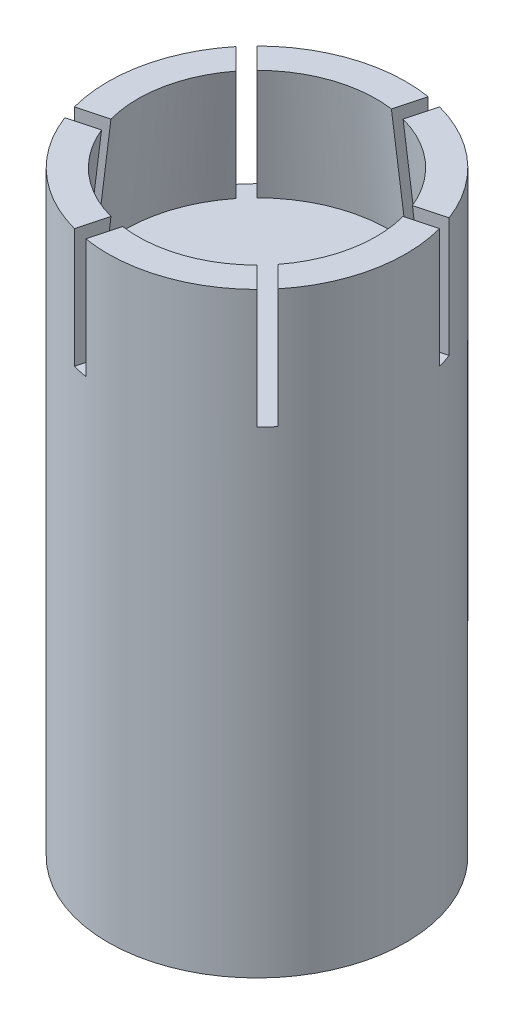
ISO-10303-21;
HEADER;
FILE_DESCRIPTION(('STEP AP214'),'2;1');
FILE_NAME('part.step','',(''),(''),'','','');
FILE_SCHEMA(('AUTOMOTIVE_DESIGN { 1 0 10303 214 1 1 1 1 }'));
ENDSEC;
DATA;
#1=APPLICATION_CONTEXT('core data for automotive mechanical design processes');
#2=APPLICATION_PROTOCOL_DEFINITION('international standard','automotive_design',2000,#1);
#3=PRODUCT_CONTEXT('',#1,'mechanical');
#4=PRODUCT('Part','Part','',(#3));
#5=PRODUCT_RELATED_PRODUCT_CATEGORY('part','',(#4));
#6=PRODUCT_DEFINITION_FORMATION('','',#4);
#7=PRODUCT_DEFINITION_CONTEXT('part definition',#1,'design');
#8=PRODUCT_DEFINITION('design','',#6,#7);
#9=PRODUCT_DEFINITION_SHAPE('','',#8);
#10=(LENGTH_UNIT() NAMED_UNIT(*) SI_UNIT(.MILLI.,.METRE.));
#11=(NAMED_UNIT(*) PLANE_ANGLE_UNIT() SI_UNIT($,.RADIAN.));
#12=(NAMED_UNIT(*) SI_UNIT($,.STERADIAN.) SOLID_ANGLE_UNIT());
#13=UNCERTAINTY_MEASURE_WITH_UNIT(LENGTH_MEASURE(1.E-05),#10,'distance_accuracy_value','');
#14=(GEOMETRIC_REPRESENTATION_CONTEXT(3) GLOBAL_UNCERTAINTY_ASSIGNED_CONTEXT((#13)) GLOBAL_UNIT_ASSIGNED_CONTEXT((#10,
#11,#12)) REPRESENTATION_CONTEXT('',''));
#15=CARTESIAN_POINT('',(0.,0.,0.));
#16=DIRECTION('',(0.,0.,1.));
#17=DIRECTION('',(1.,0.,0.));
#18=AXIS2_PLACEMENT_3D('',#15,#16,#17);
#19=CARTESIAN_POINT('',(0.,5.53381234632872,0.));
#20=DIRECTION('',(0.,1.,0.));
#21=DIRECTION('',(0.,0.,1.));
#22=AXIS2_PLACEMENT_3D('',#19,#20,#21);
#23=CYLINDRICAL_SURFACE('',#22,5.00000000000001);
#24=CARTESIAN_POINT('',(0.,-20.,0.));
#25=DIRECTION('',(0.,1.,0.));
#26=DIRECTION('',(0.,0.,1.));
#27=AXIS2_PLACEMENT_3D('',#24,#25,#26);
#28=CIRCLE('',#27,5.00000000000001);
#29=CARTESIAN_POINT('',(0.,-20.,5.00000000000001));
#30=VERTEX_POINT('',#29);
#31=EDGE_CURVE('E294',#30,#30,#28,.T.);
#32=ORIENTED_EDGE('',*,*,#31,.T.);
#33=EDGE_LOOP('',(#32));
#34=FACE_BOUND('',#33,.T.);
#35=DIRECTION('',(0.,1.,0.));
#36=VECTOR('',#35,1.);
#37=CARTESIAN_POINT('',(-4.67601078912102,5.53381234632872,1.77057140494924));
#38=LINE('',#37,#36);
#39=CARTESIAN_POINT('',(-4.67601078912102,-4.,1.77057140494924));
#40=VERTEX_POINT('',#39);
#41=CARTESIAN_POINT('',(-4.67601078912102,0.,1.77057140494924));
#42=VERTEX_POINT('',#41);
#43=EDGE_CURVE('E270',#40,#42,#38,.T.);
#44=ORIENTED_EDGE('',*,*,#43,.F.);
#45=CARTESIAN_POINT('',(0.,-4.,0.));
#46=DIRECTION('',(0.,-1.,0.));
#47=DIRECTION('',(-0.86602540378444,0.,-0.499999999999998));
#48=AXIS2_PLACEMENT_3D('',#45,#46,#47);
#49=CIRCLE('',#48,5.00000000000001);
#50=CARTESIAN_POINT('',(-4.82962913144535,-4.,1.29409522551261));
#51=VERTEX_POINT('',#50);
#52=EDGE_CURVE('E277',#40,#51,#49,.T.);
#53=ORIENTED_EDGE('',*,*,#52,.T.);
#54=DIRECTION('',(0.,1.,0.));
#55=VECTOR('',#54,1.);
#56=CARTESIAN_POINT('',(-4.82962913144535,5.53381234632872,1.29409522551261));
#57=LINE('',#56,#55);
#58=CARTESIAN_POINT('',(-4.82962913144535,0.,1.29409522551261));
#59=VERTEX_POINT('',#58);
#60=EDGE_CURVE('E267',#51,#59,#57,.T.);
#61=ORIENTED_EDGE('',*,*,#60,.T.);
#62=CARTESIAN_POINT('',(0.,0.,0.));
#63=DIRECTION('',(0.,1.,0.));
#64=DIRECTION('',(0.,0.,1.));
#65=AXIS2_PLACEMENT_3D('',#62,#63,#64);
#66=CIRCLE('',#65,5.00000000000001);
#67=CARTESIAN_POINT('',(-3.87136521046085,0.,-3.16425842927431));
#68=VERTEX_POINT('',#67);
#69=EDGE_CURVE('E291',#68,#59,#66,.T.);
#70=ORIENTED_EDGE('',*,*,#69,.F.);
#71=DIRECTION('',(0.,1.,0.));
#72=VECTOR('',#71,1.);
#73=CARTESIAN_POINT('',(-3.87136521046085,5.53381234632872,-3.16425842927431));
#74=LINE('',#73,#72);
#75=CARTESIAN_POINT('',(-3.87136521046085,-4.,-3.16425842927431));
#76=VERTEX_POINT('',#75);
#77=EDGE_CURVE('E288',#76,#68,#74,.T.);
#78=ORIENTED_EDGE('',*,*,#77,.F.);
#79=CARTESIAN_POINT('',(0.,-4.,0.));
#80=DIRECTION('',(0.,-1.,0.));
#81=DIRECTION('',(0.,0.,-1.));
#82=AXIS2_PLACEMENT_3D('',#79,#80,#81);
#83=CIRCLE('',#82,5.00000000000001);
#84=CARTESIAN_POINT('',(-3.53553390593274,-4.,-3.53553390593275));
#85=VERTEX_POINT('',#84);
#86=EDGE_CURVE('E43',#76,#85,#83,.T.);
#87=ORIENTED_EDGE('',*,*,#86,.T.);
#88=DIRECTION('',(0.,1.,0.));
#89=VECTOR('',#88,1.);
#90=CARTESIAN_POINT('',(-3.53553390593274,5.53381234632872,-3.53553390593275));
#91=LINE('',#90,#89);
#92=CARTESIAN_POINT('',(-3.53553390593274,0.,-3.53553390593275));
#93=VERTEX_POINT('',#92);
#94=EDGE_CURVE('E285',#85,#93,#91,.T.);
#95=ORIENTED_EDGE('',*,*,#94,.T.);
#96=CARTESIAN_POINT('',(0.804645578660117,0.,-4.93482983422355));
#97=VERTEX_POINT('',#96);
#98=EDGE_CURVE('E290',#97,#93,#66,.T.);
#99=ORIENTED_EDGE('',*,*,#98,.F.);
#100=DIRECTION('',(0.,1.,0.));
#101=VECTOR('',#100,1.);
#102=CARTESIAN_POINT('',(0.804645578660117,5.53381234632872,-4.93482983422355));
#103=LINE('',#102,#101);
#104=CARTESIAN_POINT('',(0.804645578660117,-4.,-4.93482983422355));
#105=VERTEX_POINT('',#104);
#106=EDGE_CURVE('E636',#105,#97,#103,.T.);
#107=ORIENTED_EDGE('',*,*,#106,.F.);
#108=CARTESIAN_POINT('',(0.,-4.,0.));
#109=DIRECTION('',(0.,-1.,0.));
#110=DIRECTION('',(0.866025403784433,0.,-0.50000000000001));
#111=AXIS2_PLACEMENT_3D('',#108,#109,#110);
#112=CIRCLE('',#111,5.00000000000001);
#113=CARTESIAN_POINT('',(1.29409522551256,-4.,-4.82962913144536));
#114=VERTEX_POINT('',#113);
#115=EDGE_CURVE('E644',#105,#114,#112,.T.);
#116=ORIENTED_EDGE('',*,*,#115,.T.);
#117=DIRECTION('',(0.,1.,0.));
#118=VECTOR('',#117,1.);
#119=CARTESIAN_POINT('',(1.29409522551256,5.53381234632872,-4.82962913144536));
#120=LINE('',#119,#118);
#121=CARTESIAN_POINT('',(1.29409522551256,0.,-4.82962913144536));
#122=VERTEX_POINT('',#121);
#123=EDGE_CURVE('E632',#114,#122,#120,.T.);
#124=ORIENTED_EDGE('',*,*,#123,.T.);
#125=CARTESIAN_POINT('',(4.676010789121,0.,-1.77057140494927));
#126=VERTEX_POINT('',#125);
#127=EDGE_CURVE('E627',#126,#122,#66,.T.);
#128=ORIENTED_EDGE('',*,*,#127,.F.);
#129=DIRECTION('',(0.,1.,0.));
#130=VECTOR('',#129,1.);
#131=CARTESIAN_POINT('',(4.676010789121,5.53381234632872,-1.77057140494927));
#132=LINE('',#131,#130);
#133=CARTESIAN_POINT('',(4.676010789121,-4.,-1.77057140494927));
#134=VERTEX_POINT('',#133);
#135=EDGE_CURVE('E656',#134,#126,#132,.T.);
#136=ORIENTED_EDGE('',*,*,#135,.F.);
#137=CARTESIAN_POINT('',(0.,-4.,0.));
#138=DIRECTION('',(0.,-1.,0.));
#139=DIRECTION('',(0.866025403784443,0.,0.499999999999992));
#140=AXIS2_PLACEMENT_3D('',#137,#138,#139);
#141=CIRCLE('',#140,5.00000000000001);
#142=CARTESIAN_POINT('',(4.82962913144534,-4.,-1.29409522551264));
#143=VERTEX_POINT('',#142);
#144=EDGE_CURVE('E221',#134,#143,#141,.T.);
#145=ORIENTED_EDGE('',*,*,#144,.T.);
#146=DIRECTION('',(0.,1.,0.));
#147=VECTOR('',#146,1.);
#148=CARTESIAN_POINT('',(4.82962913144534,5.53381234632872,-1.29409522551264));
#149=LINE('',#148,#147);
#150=CARTESIAN_POINT('',(4.82962913144534,0.,-1.29409522551264));
#151=VERTEX_POINT('',#150);
#152=EDGE_CURVE('E653',#143,#151,#149,.T.);
#153=ORIENTED_EDGE('',*,*,#152,.T.);
#154=CARTESIAN_POINT('',(3.87136521046085,0.,3.16425842927431));
#155=VERTEX_POINT('',#154);
#156=EDGE_CURVE('E684',#155,#151,#66,.T.);
#157=ORIENTED_EDGE('',*,*,#156,.F.);
#158=DIRECTION('',(0.,1.,0.));
#159=VECTOR('',#158,1.);
#160=CARTESIAN_POINT('',(3.87136521046085,5.53381234632872,3.16425842927431));
#161=LINE('',#160,#159);
#162=CARTESIAN_POINT('',(3.87136521046085,-4.,3.16425842927431));
#163=VERTEX_POINT('',#162);
#164=EDGE_CURVE('E231',#163,#155,#161,.T.);
#165=ORIENTED_EDGE('',*,*,#164,.F.);
#166=CARTESIAN_POINT('',(0.,-4.,0.));
#167=DIRECTION('',(0.,-1.,0.));
#168=DIRECTION('',(0.,0.,1.));
#169=AXIS2_PLACEMENT_3D('',#166,#167,#168);
#170=CIRCLE('',#169,5.00000000000001);
#171=CARTESIAN_POINT('',(3.53553390593274,-4.,3.53553390593275));
#172=VERTEX_POINT('',#171);
#173=EDGE_CURVE('E239',#163,#172,#170,.T.);
#174=ORIENTED_EDGE('',*,*,#173,.T.);
#175=DIRECTION('',(0.,1.,0.));
#176=VECTOR('',#175,1.);
#177=CARTESIAN_POINT('',(3.53553390593274,5.53381234632872,3.53553390593275));
#178=LINE('',#177,#176);
#179=CARTESIAN_POINT('',(3.53553390593274,0.,3.53553390593275));
#180=VERTEX_POINT('',#179);
#181=EDGE_CURVE('E223',#172,#180,#178,.T.);
#182=ORIENTED_EDGE('',*,*,#181,.T.);
#183=CARTESIAN_POINT('',(-0.804645578660152,0.,4.93482983422354));
#184=VERTEX_POINT('',#183);
#185=EDGE_CURVE('E220',#184,#180,#66,.T.);
#186=ORIENTED_EDGE('',*,*,#185,.F.);
#187=DIRECTION('',(0.,1.,0.));
#188=VECTOR('',#187,1.);
#189=CARTESIAN_POINT('',(-0.804645578660152,5.53381234632872,4.93482983422354));
#190=LINE('',#189,#188);
#191=CARTESIAN_POINT('',(-0.804645578660152,-4.,4.93482983422354));
#192=VERTEX_POINT('',#191);
#193=EDGE_CURVE('E251',#192,#184,#190,.T.);
#194=ORIENTED_EDGE('',*,*,#193,.F.);
#195=CARTESIAN_POINT('',(0.,-4.,0.));
#196=DIRECTION('',(0.,-1.,0.));
#197=DIRECTION('',(-0.866025403784436,0.,0.500000000000004));
#198=AXIS2_PLACEMENT_3D('',#195,#196,#197);
#199=CIRCLE('',#198,5.00000000000001);
#200=CARTESIAN_POINT('',(-1.29409522551259,-4.,4.82962913144535));
#201=VERTEX_POINT('',#200);
#202=EDGE_CURVE('E258',#192,#201,#199,.T.);
#203=ORIENTED_EDGE('',*,*,#202,.T.);
#204=DIRECTION('',(0.,1.,0.));
#205=VECTOR('',#204,1.);
#206=CARTESIAN_POINT('',(-1.29409522551259,5.53381234632872,4.82962913144535));
#207=LINE('',#206,#205);
#208=CARTESIAN_POINT('',(-1.29409522551259,0.,4.82962913144535));
#209=VERTEX_POINT('',#208);
#210=EDGE_CURVE('E248',#201,#209,#207,.T.);
#211=ORIENTED_EDGE('',*,*,#210,.T.);
#212=EDGE_CURVE('E295',#42,#209,#66,.T.);
#213=ORIENTED_EDGE('',*,*,#212,.F.);
#214=EDGE_LOOP('',(#44,#53,#61,#70,#78,#87,#95,#99,#107,#116,#124,#128,#136,#145,#153,#157,#165,
#174,#182,#186,#194,#203,#211,#213));
#215=FACE_BOUND('',#214,.T.);
#216=ADVANCED_FACE('F35',(#34,#215),#23,.T.);
#217=CARTESIAN_POINT('',(5.00000000000001,0.,0.));
#218=DIRECTION('',(0.,-1.,0.));
#219=DIRECTION('',(0.,0.,-1.));
#220=AXIS2_PLACEMENT_3D('',#217,#218,#219);
#221=PLANE('',#220);
#222=DIRECTION('',(0.258819045102518,0.,-0.965925826289069));
#223=VECTOR('',#222,1.);
#224=CARTESIAN_POINT('',(0.915063509461087,0.,-3.4150635094611));
#225=LINE('',#224,#223);
#226=CARTESIAN_POINT('',(-1.03527618041007,0.,3.86370330515628));
#227=VERTEX_POINT('',#226);
#228=EDGE_CURVE('E242',#209,#227,#225,.T.);
#229=ORIENTED_EDGE('',*,*,#228,.T.);
#230=CARTESIAN_POINT('',(0.,0.,0.));
#231=DIRECTION('',(0.,1.,0.));
#232=DIRECTION('',(0.,0.,1.));
#233=AXIS2_PLACEMENT_3D('',#230,#231,#232);
#234=CIRCLE('',#233,4.00000000000001);
#235=CARTESIAN_POINT('',(-3.70398975939192,0.,1.51011915500726));
#236=VERTEX_POINT('',#235);
#237=EDGE_CURVE('E206',#236,#227,#234,.T.);
#238=ORIENTED_EDGE('',*,*,#237,.F.);
#239=DIRECTION('',(0.965925826289068,0.,-0.258819045102521));
#240=VECTOR('',#239,1.);
#241=CARTESIAN_POINT('',(3.54447303201236,0.,-0.432100596316564));
#242=LINE('',#241,#240);
#243=EDGE_CURVE('E272',#42,#236,#242,.T.);
#244=ORIENTED_EDGE('',*,*,#243,.F.);
#245=ORIENTED_EDGE('',*,*,#212,.T.);
#246=EDGE_LOOP('',(#229,#238,#244,#245));
#247=FACE_BOUND('',#246,.T.);
#248=ADVANCED_FACE('F405',(#247),#221,.F.);
#249=DIRECTION('',(-0.707106781186546,0.,-0.707106781186549));
#250=VECTOR('',#249,1.);
#251=CARTESIAN_POINT('',(-2.49999999999999,0.,-2.5));
#252=LINE('',#251,#250);
#253=CARTESIAN_POINT('',(2.82842712474619,0.,2.8284271247462));
#254=VERTEX_POINT('',#253);
#255=EDGE_CURVE('E212',#180,#254,#252,.T.);
#256=ORIENTED_EDGE('',*,*,#255,.T.);
#257=CARTESIAN_POINT('',(-0.544193328718175,0.,3.96280880449445));
#258=VERTEX_POINT('',#257);
#259=EDGE_CURVE('E195',#258,#254,#234,.T.);
#260=ORIENTED_EDGE('',*,*,#259,.F.);
#261=DIRECTION('',(0.258819045102518,0.,-0.965925826289069));
#262=VECTOR('',#261,1.);
#263=CARTESIAN_POINT('',(1.39802642260562,0.,-3.28565398690984));
#264=LINE('',#263,#262);
#265=EDGE_CURVE('E253',#184,#258,#264,.T.);
#266=ORIENTED_EDGE('',*,*,#265,.F.);
#267=ORIENTED_EDGE('',*,*,#185,.T.);
#268=EDGE_LOOP('',(#256,#260,#266,#267));
#269=FACE_BOUND('',#268,.T.);
#270=ADVANCED_FACE('F218',(#269),#221,.F.);
#271=DIRECTION('',(-0.965925826289066,0.,0.258819045102528));
#272=VECTOR('',#271,1.);
#273=CARTESIAN_POINT('',(-3.41506350946109,0.,0.915063509461121));
#274=LINE('',#273,#272);
#275=CARTESIAN_POINT('',(3.86370330515627,0.,-1.03527618041012));
#276=VERTEX_POINT('',#275);
#277=EDGE_CURVE('E647',#151,#276,#274,.T.);
#278=ORIENTED_EDGE('',*,*,#277,.T.);
#279=CARTESIAN_POINT('',(3.15979643067373,0.,2.45268964948719));
#280=VERTEX_POINT('',#279);
#281=EDGE_CURVE('E208',#280,#276,#234,.T.);
#282=ORIENTED_EDGE('',*,*,#281,.F.);
#283=DIRECTION('',(-0.707106781186546,0.,-0.707106781186549));
#284=VECTOR('',#283,1.);
#285=CARTESIAN_POINT('',(-2.14644660940672,0.,-2.85355339059328));
#286=LINE('',#285,#284);
#287=EDGE_CURVE('E233',#155,#280,#286,.T.);
#288=ORIENTED_EDGE('',*,*,#287,.F.);
#289=ORIENTED_EDGE('',*,*,#156,.T.);
#290=EDGE_LOOP('',(#278,#282,#288,#289));
#291=FACE_BOUND('',#290,.T.);
#292=ADVANCED_FACE('F584',(#291),#221,.F.);
#293=DIRECTION('',(-0.258819045102511,0.,0.965925826289071));
#294=VECTOR('',#293,1.);
#295=CARTESIAN_POINT('',(-0.915063509461063,0.,3.4150635094611));
#296=LINE('',#295,#294);
#297=CARTESIAN_POINT('',(1.03527618041005,0.,-3.86370330515629));
#298=VERTEX_POINT('',#297);
#299=EDGE_CURVE('E324',#122,#298,#296,.T.);
#300=ORIENTED_EDGE('',*,*,#299,.T.);
#301=CARTESIAN_POINT('',(3.70398975939191,0.,-1.51011915500728));
#302=VERTEX_POINT('',#301);
#303=EDGE_CURVE('E624',#302,#298,#234,.T.);
#304=ORIENTED_EDGE('',*,*,#303,.F.);
#305=DIRECTION('',(-0.965925826289066,0.,0.258819045102528));
#306=VECTOR('',#305,1.);
#307=CARTESIAN_POINT('',(-3.54447303201235,0.,0.432100596316589));
#308=LINE('',#307,#306);
#309=EDGE_CURVE('E658',#126,#302,#308,.T.);
#310=ORIENTED_EDGE('',*,*,#309,.F.);
#311=ORIENTED_EDGE('',*,*,#127,.T.);
#312=EDGE_LOOP('',(#300,#304,#310,#311));
#313=FACE_BOUND('',#312,.T.);
#314=ADVANCED_FACE('F406',(#313),#221,.F.);
#315=DIRECTION('',(0.707106781186546,0.,0.707106781186549));
#316=VECTOR('',#315,1.);
#317=CARTESIAN_POINT('',(2.49999999999999,0.,2.5));
#318=LINE('',#317,#316);
#319=CARTESIAN_POINT('',(-2.82842712474619,0.,-2.8284271247462));
#320=VERTEX_POINT('',#319);
#321=EDGE_CURVE('E298',#93,#320,#318,.T.);
#322=ORIENTED_EDGE('',*,*,#321,.T.);
#323=CARTESIAN_POINT('',(0.544193328718148,0.,-3.96280880449445));
#324=VERTEX_POINT('',#323);
#325=EDGE_CURVE('E672',#324,#320,#234,.T.);
#326=ORIENTED_EDGE('',*,*,#325,.F.);
#327=DIRECTION('',(-0.258819045102511,0.,0.965925826289071));
#328=VECTOR('',#327,1.);
#329=CARTESIAN_POINT('',(-1.3980264226056,0.,3.28565398690985));
#330=LINE('',#329,#328);
#331=EDGE_CURVE('E638',#97,#324,#330,.T.);
#332=ORIENTED_EDGE('',*,*,#331,.F.);
#333=ORIENTED_EDGE('',*,*,#98,.T.);
#334=EDGE_LOOP('',(#322,#326,#332,#333));
#335=FACE_BOUND('',#334,.T.);
#336=ADVANCED_FACE('F398',(#335),#221,.F.);
#337=CARTESIAN_POINT('',(-4.24264068711928,0.5,-4.24264068711929));
#338=DIRECTION('',(0.707106781186549,0.,-0.707106781186546));
#339=DIRECTION('',(-0.707106781186546,0.,-0.707106781186549));
#340=AXIS2_PLACEMENT_3D('',#337,#338,#339);
#341=PLANE('',#340);
#342=DIRECTION('',(0.707106781186546,0.,0.707106781186549));
#343=VECTOR('',#342,1.);
#344=CARTESIAN_POINT('',(-4.24264068711928,-4.,-4.24264068711929));
#345=LINE('',#344,#343);
#346=CARTESIAN_POINT('',(-3.12570679469734,-4.,-3.12570679469734));
#347=VERTEX_POINT('',#346);
#348=EDGE_CURVE('E282',#85,#347,#345,.T.);
#349=ORIENTED_EDGE('',*,*,#348,.T.);
#350=DIRECTION('',(0.0739127852035666,0.994521895368273,0.0739127852035669));
#351=VECTOR('',#350,1.);
#352=CARTESIAN_POINT('',(0.,38.0574578168904,0.));
#353=LINE('',#352,#351);
#354=EDGE_CURVE('E320',#347,#320,#353,.T.);
#355=ORIENTED_EDGE('',*,*,#354,.T.);
#356=ORIENTED_EDGE('',*,*,#321,.F.);
#357=ORIENTED_EDGE('',*,*,#94,.F.);
#358=EDGE_LOOP('',(#349,#355,#356,#357));
#359=FACE_BOUND('',#358,.T.);
#360=ADVANCED_FACE('F395',(#359),#341,.F.);
#361=DIRECTION('',(0.965925826289068,0.,-0.258819045102521));
#362=VECTOR('',#361,1.);
#363=CARTESIAN_POINT('',(3.4150635094611,0.,-0.915063509461097));
#364=LINE('',#363,#362);
#365=CARTESIAN_POINT('',(-3.86370330515628,0.,1.03527618041009));
#366=VERTEX_POINT('',#365);
#367=EDGE_CURVE('E261',#59,#366,#364,.T.);
#368=ORIENTED_EDGE('',*,*,#367,.T.);
#369=CARTESIAN_POINT('',(-3.15979643067373,0.,-2.45268964948719));
#370=VERTEX_POINT('',#369);
#371=EDGE_CURVE('E673',#370,#366,#234,.T.);
#372=ORIENTED_EDGE('',*,*,#371,.F.);
#373=DIRECTION('',(0.707106781186546,0.,0.707106781186549));
#374=VECTOR('',#373,1.);
#375=CARTESIAN_POINT('',(2.14644660940672,0.,2.85355339059328));
#376=LINE('',#375,#374);
#377=EDGE_CURVE('E301',#68,#370,#376,.T.);
#378=ORIENTED_EDGE('',*,*,#377,.F.);
#379=ORIENTED_EDGE('',*,*,#69,.T.);
#380=EDGE_LOOP('',(#368,#372,#378,#379));
#381=FACE_BOUND('',#380,.T.);
#382=ADVANCED_FACE('F397',(#381),#221,.F.);
#383=CARTESIAN_POINT('',(0.,-20.,0.));
#384=DIRECTION('',(0.,1.,0.));
#385=DIRECTION('',(0.,0.,1.));
#386=AXIS2_PLACEMENT_3D('',#383,#384,#385);
#387=PLANE('',#386);
#388=ORIENTED_EDGE('',*,*,#31,.F.);
#389=EDGE_LOOP('',(#388));
#390=FACE_BOUND('',#389,.T.);
#391=ADVANCED_FACE('F37',(#390),#387,.F.);
#392=CARTESIAN_POINT('',(0.,-4.,0.));
#393=DIRECTION('',(0.,-1.,0.));
#394=DIRECTION('',(-1.,0.,0.));
#395=AXIS2_PLACEMENT_3D('',#392,#393,#394);
#396=PLANE('',#395);
#397=DIRECTION('',(0.707106781186546,0.,0.707106781186549));
#398=VECTOR('',#397,1.);
#399=CARTESIAN_POINT('',(-4.59619407771255,-4.,-3.88908729652602));
#400=LINE('',#399,#398);
#401=CARTESIAN_POINT('',(-3.45920033872133,-4.,-2.75209355753479));
#402=VERTEX_POINT('',#401);
#403=EDGE_CURVE('E280',#76,#402,#400,.T.);
#404=ORIENTED_EDGE('',*,*,#403,.T.);
#405=CARTESIAN_POINT('',(0.,-4.,0.));
#406=DIRECTION('',(0.,1.,0.));
#407=DIRECTION('',(0.,0.,1.));
#408=AXIS2_PLACEMENT_3D('',#405,#406,#407);
#409=CIRCLE('',#408,4.42041694106271);
#410=CARTESIAN_POINT('',(-4.2697948863382,-4.,1.14408809164086));
#411=VERTEX_POINT('',#410);
#412=EDGE_CURVE('E50',#402,#411,#409,.T.);
#413=ORIENTED_EDGE('',*,*,#412,.T.);
#414=DIRECTION('',(0.965925826289068,0.,-0.258819045102521));
#415=VECTOR('',#414,1.);
#416=CARTESIAN_POINT('',(-5.79555495773441,-4.,1.55291427061513));
#417=LINE('',#416,#415);
#418=EDGE_CURVE('E264',#51,#411,#417,.T.);
#419=ORIENTED_EDGE('',*,*,#418,.F.);
#420=ORIENTED_EDGE('',*,*,#52,.F.);
#421=DIRECTION('',(0.965925826289068,0.,-0.258819045102521));
#422=VECTOR('',#421,1.);
#423=CARTESIAN_POINT('',(-5.66614543518315,-4.,2.03587718375966));
#424=LINE('',#423,#422);
#425=CARTESIAN_POINT('',(-4.11298310377728,-4.,1.61970859134502));
#426=VERTEX_POINT('',#425);
#427=EDGE_CURVE('E275',#40,#426,#424,.T.);
#428=ORIENTED_EDGE('',*,*,#427,.T.);
#429=CARTESIAN_POINT('',(-1.14408809164084,-4.,4.2697948863382));
#430=VERTEX_POINT('',#429);
#431=EDGE_CURVE('E57',#426,#430,#409,.T.);
#432=ORIENTED_EDGE('',*,*,#431,.T.);
#433=DIRECTION('',(0.258819045102518,0.,-0.965925826289069));
#434=VECTOR('',#433,1.);
#435=CARTESIAN_POINT('',(-1.55291427061511,-4.,5.79555495773441));
#436=LINE('',#435,#434);
#437=EDGE_CURVE('E245',#201,#430,#436,.T.);
#438=ORIENTED_EDGE('',*,*,#437,.F.);
#439=ORIENTED_EDGE('',*,*,#202,.F.);
#440=DIRECTION('',(0.258819045102518,0.,-0.965925826289069));
#441=VECTOR('',#440,1.);
#442=CARTESIAN_POINT('',(-1.06995135747057,-4.,5.92496448028567));
#443=LINE('',#442,#441);
#444=CARTESIAN_POINT('',(-0.653782765055934,-4.,4.3718021488798));
#445=VERTEX_POINT('',#444);
#446=EDGE_CURVE('E255',#192,#445,#443,.T.);
#447=ORIENTED_EDGE('',*,*,#446,.T.);
#448=CARTESIAN_POINT('',(3.12570679469733,-4.,3.12570679469734));
#449=VERTEX_POINT('',#448);
#450=EDGE_CURVE('E668',#445,#449,#409,.T.);
#451=ORIENTED_EDGE('',*,*,#450,.T.);
#452=DIRECTION('',(-0.707106781186546,0.,-0.707106781186549));
#453=VECTOR('',#452,1.);
#454=CARTESIAN_POINT('',(4.24264068711928,-4.,4.24264068711929));
#455=LINE('',#454,#453);
#456=EDGE_CURVE('E214',#172,#449,#455,.T.);
#457=ORIENTED_EDGE('',*,*,#456,.F.);
#458=ORIENTED_EDGE('',*,*,#173,.F.);
#459=DIRECTION('',(-0.707106781186546,0.,-0.707106781186549));
#460=VECTOR('',#459,1.);
#461=CARTESIAN_POINT('',(4.59619407771255,-4.,3.88908729652602));
#462=LINE('',#461,#460);
#463=CARTESIAN_POINT('',(3.45920033872133,-4.,2.75209355753479));
#464=VERTEX_POINT('',#463);
#465=EDGE_CURVE('E236',#163,#464,#462,.T.);
#466=ORIENTED_EDGE('',*,*,#465,.T.);
#467=CARTESIAN_POINT('',(4.26979488633819,-4.,-1.14408809164089));
#468=VERTEX_POINT('',#467);
#469=EDGE_CURVE('E666',#464,#468,#409,.T.);
#470=ORIENTED_EDGE('',*,*,#469,.T.);
#471=DIRECTION('',(-0.965925826289066,0.,0.258819045102528));
#472=VECTOR('',#471,1.);
#473=CARTESIAN_POINT('',(5.7955549577344,-4.,-1.55291427061517));
#474=LINE('',#473,#472);
#475=EDGE_CURVE('E650',#143,#468,#474,.T.);
#476=ORIENTED_EDGE('',*,*,#475,.F.);
#477=ORIENTED_EDGE('',*,*,#144,.F.);
#478=DIRECTION('',(-0.965925826289066,0.,0.258819045102528));
#479=VECTOR('',#478,1.);
#480=CARTESIAN_POINT('',(5.66614543518313,-4.,-2.0358771837597));
#481=LINE('',#480,#479);
#482=CARTESIAN_POINT('',(4.11298310377727,-4.,-1.61970859134505));
#483=VERTEX_POINT('',#482);
#484=EDGE_CURVE('E226',#134,#483,#481,.T.);
#485=ORIENTED_EDGE('',*,*,#484,.T.);
#486=CARTESIAN_POINT('',(1.14408809164081,-4.,-4.26979488633821));
#487=VERTEX_POINT('',#486);
#488=EDGE_CURVE('E661',#483,#487,#409,.T.);
#489=ORIENTED_EDGE('',*,*,#488,.T.);
#490=DIRECTION('',(-0.258819045102511,0.,0.965925826289071));
#491=VECTOR('',#490,1.);
#492=CARTESIAN_POINT('',(1.55291427061507,-4.,-5.79555495773442));
#493=LINE('',#492,#491);
#494=EDGE_CURVE('E630',#114,#487,#493,.T.);
#495=ORIENTED_EDGE('',*,*,#494,.F.);
#496=ORIENTED_EDGE('',*,*,#115,.F.);
#497=DIRECTION('',(-0.258819045102511,0.,0.965925826289071));
#498=VECTOR('',#497,1.);
#499=CARTESIAN_POINT('',(1.06995135747053,-4.,-5.92496448028568));
#500=LINE('',#499,#498);
#501=CARTESIAN_POINT('',(0.653782765055904,-4.,-4.37180214887981));
#502=VERTEX_POINT('',#501);
#503=EDGE_CURVE('E641',#105,#502,#500,.T.);
#504=ORIENTED_EDGE('',*,*,#503,.T.);
#505=EDGE_CURVE('E670',#502,#347,#409,.T.);
#506=ORIENTED_EDGE('',*,*,#505,.T.);
#507=ORIENTED_EDGE('',*,*,#348,.F.);
#508=ORIENTED_EDGE('',*,*,#86,.F.);
#509=EDGE_LOOP('',(#404,#413,#419,#420,#428,#432,#438,#439,#447,#451,#457,#458,#466,#470,#476,
#477,#485,#489,#495,#496,#504,#506,#507,#508));
#510=FACE_BOUND('',#509,.T.);
#511=ADVANCED_FACE('F311',(#510),#396,.F.);
#512=CARTESIAN_POINT('',(-4.59619407771255,0.5,-3.88908729652602));
#513=DIRECTION('',(0.707106781186549,0.,-0.707106781186546));
#514=DIRECTION('',(-0.707106781186546,0.,-0.707106781186549));
#515=AXIS2_PLACEMENT_3D('',#512,#513,#514);
#516=PLANE('',#515);
#517=CARTESIAN_POINT('',(-3.4592152987131,-4.0002,-2.75210851752656));
#518=CARTESIAN_POINT('',(-3.40934500095908,-3.33346137567296,-2.70223821977254));
#519=CARTESIAN_POINT('',(-3.35945703128989,-2.66672539686616,-2.65235025010336));
#520=CARTESIAN_POINT('',(-3.25964574811418,-1.3332587301995,-2.55253896692764));
#521=CARTESIAN_POINT('',(-3.20972243460764,-0.666528042339627,-2.50261565342111));
#522=CARTESIAN_POINT('',(-3.15978144918593,0.000199999999999711,-2.4526746679994));
#523=B_SPLINE_CURVE_WITH_KNOTS('',3,(#517,#518,#519,#520,#521,#522),.UNSPECIFIED.,.F.,.F.,(4,2,
4),(0.,2.01137524103236,4.02275048234695),.UNSPECIFIED.);
#524=EDGE_CURVE('E317',#402,#370,#523,.T.);
#525=ORIENTED_EDGE('',*,*,#524,.F.);
#526=ORIENTED_EDGE('',*,*,#403,.F.);
#527=ORIENTED_EDGE('',*,*,#77,.T.);
#528=ORIENTED_EDGE('',*,*,#377,.T.);
#529=EDGE_LOOP('',(#525,#526,#527,#528));
#530=FACE_BOUND('',#529,.T.);
#531=ADVANCED_FACE('F315',(#530),#516,.T.);
#532=CARTESIAN_POINT('',(1.06995135747053,0.5,-5.92496448028568));
#533=DIRECTION('',(0.965925826289071,0.,0.258819045102511));
#534=DIRECTION('',(0.258819045102511,0.,-0.965925826289071));
#535=AXIS2_PLACEMENT_3D('',#532,#533,#534);
#536=PLANE('',#535);
#537=CARTESIAN_POINT('',(0.653788240792933,-4.0002,-4.3718225846086));
#538=CARTESIAN_POINT('',(0.635534444920669,-3.33346137567296,-4.30369849098232));
#539=CARTESIAN_POINT('',(0.61727418067852,-2.66672539686616,-4.23555025707099));
#540=CARTESIAN_POINT('',(0.580740715451887,-1.3332587301995,-4.09920550866863));
#541=CARTESIAN_POINT('',(0.562467514467401,-0.666528042339627,-4.03100899417761));
#542=CARTESIAN_POINT('',(0.544187845113028,0.000199999999999709,-3.96278833940153));
#543=B_SPLINE_CURVE_WITH_KNOTS('',3,(#537,#538,#539,#540,#541,#542),.UNSPECIFIED.,.F.,.F.,(4,2,
4),(0.,2.01137524103236,4.02275048234695),.UNSPECIFIED.);
#544=EDGE_CURVE('E321',#502,#324,#543,.T.);
#545=ORIENTED_EDGE('',*,*,#544,.F.);
#546=ORIENTED_EDGE('',*,*,#503,.F.);
#547=ORIENTED_EDGE('',*,*,#106,.T.);
#548=ORIENTED_EDGE('',*,*,#331,.T.);
#549=EDGE_LOOP('',(#545,#546,#547,#548));
#550=FACE_BOUND('',#549,.T.);
#551=ADVANCED_FACE('F392',(#550),#536,.T.);
#552=CARTESIAN_POINT('',(-5.66614543518315,0.5,2.03587718375966));
#553=DIRECTION('',(-0.258819045102521,0.,-0.965925826289068));
#554=DIRECTION('',(-0.965925826289068,0.,0.258819045102521));
#555=AXIS2_PLACEMENT_3D('',#552,#553,#554);
#556=PLANE('',#555);
#557=CARTESIAN_POINT('',(-4.11300353950608,-4.0002,1.61971406708205));
#558=CARTESIAN_POINT('',(-4.0448794458798,-3.33346137567296,1.60146027120978));
#559=CARTESIAN_POINT('',(-3.97673121196846,-2.66672539686616,1.58320000696763));
#560=CARTESIAN_POINT('',(-3.84038646356611,-1.3332587301995,1.546666541741));
#561=CARTESIAN_POINT('',(-3.77218994907509,-0.666528042339627,1.52839334075651));
#562=CARTESIAN_POINT('',(-3.703969294299,0.00019999999999971,1.51011367140214));
#563=B_SPLINE_CURVE_WITH_KNOTS('',3,(#557,#558,#559,#560,#561,#562),.UNSPECIFIED.,.F.,.F.,(4,2,
4),(0.,2.01137524103236,4.02275048234695),.UNSPECIFIED.);
#564=EDGE_CURVE('E326',#426,#236,#563,.T.);
#565=ORIENTED_EDGE('',*,*,#564,.F.);
#566=ORIENTED_EDGE('',*,*,#427,.F.);
#567=ORIENTED_EDGE('',*,*,#43,.T.);
#568=ORIENTED_EDGE('',*,*,#243,.T.);
#569=EDGE_LOOP('',(#565,#566,#567,#568));
#570=FACE_BOUND('',#569,.T.);
#571=ADVANCED_FACE('F386',(#570),#556,.T.);
#572=CARTESIAN_POINT('',(-5.79555495773441,0.5,1.55291427061513));
#573=DIRECTION('',(-0.258819045102521,0.,-0.965925826289068));
#574=DIRECTION('',(-0.965925826289068,0.,0.258819045102521));
#575=AXIS2_PLACEMENT_3D('',#572,#573,#574);
#576=PLANE('',#575);
#577=ORIENTED_EDGE('',*,*,#418,.T.);
#578=DIRECTION('',(0.100966742252535,0.994521895368274,-0.0270539570489681));
#579=VECTOR('',#578,1.);
#580=CARTESIAN_POINT('',(0.,38.0574578168904,0.));
#581=LINE('',#580,#579);
#582=EDGE_CURVE('E385',#411,#366,#581,.T.);
#583=ORIENTED_EDGE('',*,*,#582,.T.);
#584=ORIENTED_EDGE('',*,*,#367,.F.);
#585=ORIENTED_EDGE('',*,*,#60,.F.);
#586=EDGE_LOOP('',(#577,#583,#584,#585));
#587=FACE_BOUND('',#586,.T.);
#588=ADVANCED_FACE('F391',(#587),#576,.F.);
#589=CARTESIAN_POINT('',(-1.55291427061511,0.5,5.79555495773441));
#590=DIRECTION('',(-0.965925826289069,0.,-0.258819045102518));
#591=DIRECTION('',(-0.258819045102518,0.,0.965925826289069));
#592=AXIS2_PLACEMENT_3D('',#589,#590,#591);
#593=PLANE('',#592);
#594=ORIENTED_EDGE('',*,*,#437,.T.);
#595=DIRECTION('',(0.0270539570489677,0.994521895368273,-0.100966742252535));
#596=VECTOR('',#595,1.);
#597=CARTESIAN_POINT('',(0.,38.0574578168904,0.));
#598=LINE('',#597,#596);
#599=EDGE_CURVE('E678',#430,#227,#598,.T.);
#600=ORIENTED_EDGE('',*,*,#599,.T.);
#601=ORIENTED_EDGE('',*,*,#228,.F.);
#602=ORIENTED_EDGE('',*,*,#210,.F.);
#603=EDGE_LOOP('',(#594,#600,#601,#602));
#604=FACE_BOUND('',#603,.T.);
#605=ADVANCED_FACE('F446',(#604),#593,.F.);
#606=CARTESIAN_POINT('',(-1.06995135747057,0.5,5.92496448028567));
#607=DIRECTION('',(-0.965925826289069,0.,-0.258819045102518));
#608=DIRECTION('',(-0.258819045102518,0.,0.965925826289069));
#609=AXIS2_PLACEMENT_3D('',#606,#607,#608);
#610=PLANE('',#609);
#611=CARTESIAN_POINT('',(-0.653788240792962,-4.0002,4.3718225846086));
#612=CARTESIAN_POINT('',(-0.635534444920698,-3.33346137567296,4.30369849098232));
#613=CARTESIAN_POINT('',(-0.617274180678549,-2.66672539686616,4.23555025707098));
#614=CARTESIAN_POINT('',(-0.580740715451915,-1.3332587301995,4.09920550866863));
#615=CARTESIAN_POINT('',(-0.562467514467428,-0.666528042339627,4.03100899417761));
#616=CARTESIAN_POINT('',(-0.544187845113055,0.000199999999999711,3.96278833940153));
#617=B_SPLINE_CURVE_WITH_KNOTS('',3,(#611,#612,#613,#614,#615,#616),.UNSPECIFIED.,.F.,.F.,(4,2,
4),(0.,2.01137524103236,4.02275048234695),.UNSPECIFIED.);
#618=EDGE_CURVE('E201',#445,#258,#617,.T.);
#619=ORIENTED_EDGE('',*,*,#618,.F.);
#620=ORIENTED_EDGE('',*,*,#446,.F.);
#621=ORIENTED_EDGE('',*,*,#193,.T.);
#622=ORIENTED_EDGE('',*,*,#265,.T.);
#623=EDGE_LOOP('',(#619,#620,#621,#622));
#624=FACE_BOUND('',#623,.T.);
#625=ADVANCED_FACE('F453',(#624),#610,.T.);
#626=CARTESIAN_POINT('',(4.24264068711928,0.5,4.24264068711929));
#627=DIRECTION('',(-0.707106781186549,0.,0.707106781186546));
#628=DIRECTION('',(0.707106781186546,0.,0.707106781186549));
#629=AXIS2_PLACEMENT_3D('',#626,#627,#628);
#630=PLANE('',#629);
#631=ORIENTED_EDGE('',*,*,#456,.T.);
#632=DIRECTION('',(-0.0739127852035666,0.994521895368273,-0.0739127852035669));
#633=VECTOR('',#632,1.);
#634=CARTESIAN_POINT('',(0.,38.0574578168904,0.));
#635=LINE('',#634,#633);
#636=EDGE_CURVE('E198',#449,#254,#635,.T.);
#637=ORIENTED_EDGE('',*,*,#636,.T.);
#638=ORIENTED_EDGE('',*,*,#255,.F.);
#639=ORIENTED_EDGE('',*,*,#181,.F.);
#640=EDGE_LOOP('',(#631,#637,#638,#639));
#641=FACE_BOUND('',#640,.T.);
#642=ADVANCED_FACE('F210',(#641),#630,.F.);
#643=CARTESIAN_POINT('',(4.59619407771255,0.5,3.88908729652602));
#644=DIRECTION('',(-0.707106781186549,0.,0.707106781186546));
#645=DIRECTION('',(0.707106781186546,0.,0.707106781186549));
#646=AXIS2_PLACEMENT_3D('',#643,#644,#645);
#647=PLANE('',#646);
#648=CARTESIAN_POINT('',(3.4592152987131,-4.0002,2.75210851752656));
#649=CARTESIAN_POINT('',(3.40934500095908,-3.33346137567296,2.70223821977254));
#650=CARTESIAN_POINT('',(3.35945703128989,-2.66672539686616,2.65235025010336));
#651=CARTESIAN_POINT('',(3.25964574811418,-1.3332587301995,2.55253896692764));
#652=CARTESIAN_POINT('',(3.20972243460764,-0.66652804233963,2.50261565342111));
#653=CARTESIAN_POINT('',(3.15978144918594,0.000199999999996318,2.4526746679994));
#654=B_SPLINE_CURVE_WITH_KNOTS('',3,(#648,#649,#650,#651,#652,#653),.UNSPECIFIED.,.F.,.F.,(4,2,
4),(0.,2.01137524103235,4.02275048234695),.UNSPECIFIED.);
#655=EDGE_CURVE('E215',#464,#280,#654,.T.);
#656=ORIENTED_EDGE('',*,*,#655,.F.);
#657=ORIENTED_EDGE('',*,*,#465,.F.);
#658=ORIENTED_EDGE('',*,*,#164,.T.);
#659=ORIENTED_EDGE('',*,*,#287,.T.);
#660=EDGE_LOOP('',(#656,#657,#658,#659));
#661=FACE_BOUND('',#660,.T.);
#662=ADVANCED_FACE('F467',(#661),#647,.T.);
#663=CARTESIAN_POINT('',(5.7955549577344,0.5,-1.55291427061517));
#664=DIRECTION('',(0.258819045102528,0.,0.965925826289066));
#665=DIRECTION('',(0.965925826289066,0.,-0.258819045102528));
#666=AXIS2_PLACEMENT_3D('',#663,#664,#665);
#667=PLANE('',#666);
#668=ORIENTED_EDGE('',*,*,#475,.T.);
#669=DIRECTION('',(-0.100966742252535,0.994521895368273,0.0270539570489688));
#670=VECTOR('',#669,1.);
#671=CARTESIAN_POINT('',(0.,38.0574578168904,0.));
#672=LINE('',#671,#670);
#673=EDGE_CURVE('E665',#468,#276,#672,.T.);
#674=ORIENTED_EDGE('',*,*,#673,.T.);
#675=ORIENTED_EDGE('',*,*,#277,.F.);
#676=ORIENTED_EDGE('',*,*,#152,.F.);
#677=EDGE_LOOP('',(#668,#674,#675,#676));
#678=FACE_BOUND('',#677,.T.);
#679=ADVANCED_FACE('F474',(#678),#667,.F.);
#680=CARTESIAN_POINT('',(5.66614543518313,0.5,-2.0358771837597));
#681=DIRECTION('',(0.258819045102528,0.,0.965925826289066));
#682=DIRECTION('',(0.965925826289066,0.,-0.258819045102528));
#683=AXIS2_PLACEMENT_3D('',#680,#681,#682);
#684=PLANE('',#683);
#685=CARTESIAN_POINT('',(4.11300353950607,-4.0002,-1.61971406708208));
#686=CARTESIAN_POINT('',(4.04487944587978,-3.33346137567296,-1.60146027120981));
#687=CARTESIAN_POINT('',(3.97673121196845,-2.66672539686616,-1.58320000696766));
#688=CARTESIAN_POINT('',(3.8403864635661,-1.3332587301995,-1.54666654174103));
#689=CARTESIAN_POINT('',(3.77218994907508,-0.666528042339627,-1.52839334075654));
#690=CARTESIAN_POINT('',(3.70396929429899,0.000199999999999711,-1.51011367140216));
#691=B_SPLINE_CURVE_WITH_KNOTS('',3,(#685,#686,#687,#688,#689,#690),.UNSPECIFIED.,.F.,.F.,(4,2,
4),(0.,2.01137524103236,4.02275048234695),.UNSPECIFIED.);
#692=EDGE_CURVE('E355',#483,#302,#691,.T.);
#693=ORIENTED_EDGE('',*,*,#692,.F.);
#694=ORIENTED_EDGE('',*,*,#484,.F.);
#695=ORIENTED_EDGE('',*,*,#135,.T.);
#696=ORIENTED_EDGE('',*,*,#309,.T.);
#697=EDGE_LOOP('',(#693,#694,#695,#696));
#698=FACE_BOUND('',#697,.T.);
#699=ADVANCED_FACE('F481',(#698),#684,.T.);
#700=CARTESIAN_POINT('',(1.55291427061507,0.5,-5.79555495773442));
#701=DIRECTION('',(0.965925826289071,0.,0.258819045102511));
#702=DIRECTION('',(0.258819045102511,0.,-0.965925826289071));
#703=AXIS2_PLACEMENT_3D('',#700,#701,#702);
#704=PLANE('',#703);
#705=ORIENTED_EDGE('',*,*,#494,.T.);
#706=DIRECTION('',(-0.027053957048967,0.994521895368274,0.100966742252535));
#707=VECTOR('',#706,1.);
#708=CARTESIAN_POINT('',(0.,38.0574578168904,0.));
#709=LINE('',#708,#707);
#710=EDGE_CURVE('E11',#487,#298,#709,.T.);
#711=ORIENTED_EDGE('',*,*,#710,.T.);
#712=ORIENTED_EDGE('',*,*,#299,.F.);
#713=ORIENTED_EDGE('',*,*,#123,.F.);
#714=EDGE_LOOP('',(#705,#711,#712,#713));
#715=FACE_BOUND('',#714,.T.);
#716=ADVANCED_FACE('F349',(#715),#704,.F.);
#717=CARTESIAN_POINT('',(0.,0.,0.));
#718=DIRECTION('',(0.,-1.,0.));
#719=DIRECTION('',(0.,0.,1.));
#720=AXIS2_PLACEMENT_3D('',#717,#718,#719);
#721=CONICAL_SURFACE('',#720,4.00000000000001,0.10471975511966);
#722=ORIENTED_EDGE('',*,*,#692,.T.);
#723=ORIENTED_EDGE('',*,*,#303,.T.);
#724=ORIENTED_EDGE('',*,*,#710,.F.);
#725=ORIENTED_EDGE('',*,*,#488,.F.);
#726=EDGE_LOOP('',(#722,#723,#724,#725));
#727=FACE_BOUND('',#726,.T.);
#728=ADVANCED_FACE('F344',(#727),#721,.F.);
#729=ORIENTED_EDGE('',*,*,#655,.T.);
#730=ORIENTED_EDGE('',*,*,#281,.T.);
#731=ORIENTED_EDGE('',*,*,#673,.F.);
#732=ORIENTED_EDGE('',*,*,#469,.F.);
#733=EDGE_LOOP('',(#729,#730,#731,#732));
#734=FACE_BOUND('',#733,.T.);
#735=ADVANCED_FACE('F348',(#734),#721,.F.);
#736=ORIENTED_EDGE('',*,*,#618,.T.);
#737=ORIENTED_EDGE('',*,*,#259,.T.);
#738=ORIENTED_EDGE('',*,*,#636,.F.);
#739=ORIENTED_EDGE('',*,*,#450,.F.);
#740=EDGE_LOOP('',(#736,#737,#738,#739));
#741=FACE_BOUND('',#740,.T.);
#742=ADVANCED_FACE('F197',(#741),#721,.F.);
#743=ORIENTED_EDGE('',*,*,#564,.T.);
#744=ORIENTED_EDGE('',*,*,#237,.T.);
#745=ORIENTED_EDGE('',*,*,#599,.F.);
#746=ORIENTED_EDGE('',*,*,#431,.F.);
#747=EDGE_LOOP('',(#743,#744,#745,#746));
#748=FACE_BOUND('',#747,.T.);
#749=ADVANCED_FACE('F511',(#748),#721,.F.);
#750=ORIENTED_EDGE('',*,*,#524,.T.);
#751=ORIENTED_EDGE('',*,*,#371,.T.);
#752=ORIENTED_EDGE('',*,*,#582,.F.);
#753=ORIENTED_EDGE('',*,*,#412,.F.);
#754=EDGE_LOOP('',(#750,#751,#752,#753));
#755=FACE_BOUND('',#754,.T.);
#756=ADVANCED_FACE('F517',(#755),#721,.F.);
#757=ORIENTED_EDGE('',*,*,#505,.F.);
#758=ORIENTED_EDGE('',*,*,#544,.T.);
#759=ORIENTED_EDGE('',*,*,#325,.T.);
#760=ORIENTED_EDGE('',*,*,#354,.F.);
#761=EDGE_LOOP('',(#757,#758,#759,#760));
#762=FACE_BOUND('',#761,.T.);
#763=ADVANCED_FACE('F351',(#762),#721,.F.);
#764=CLOSED_SHELL('',(#216,#248,#270,#292,#314,#336,#360,#382,#391,#511,#531,#551,#571,#588,
#605,#625,#642,#662,#679,#699,#716,#728,#735,#742,#749,#756,#763));
#765=MANIFOLD_SOLID_BREP('B2',#764);
#766=ADVANCED_BREP_SHAPE_REPRESENTATION('',(#18,#765),#14);
#767=SHAPE_DEFINITION_REPRESENTATION(#9,#766);
ENDSEC;
END-ISO-10303-21;
